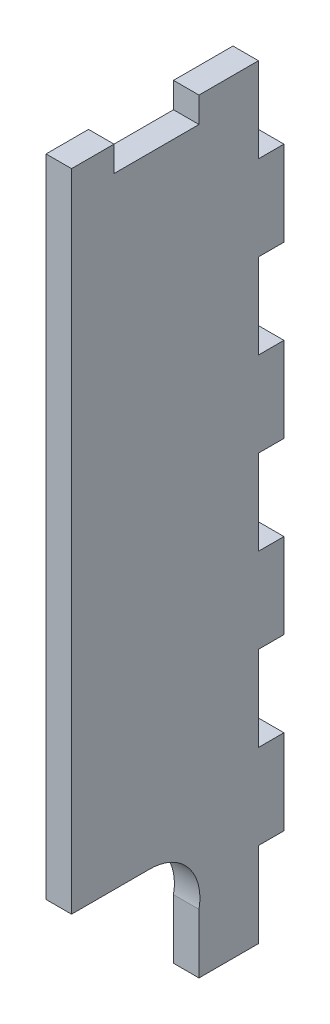
ISO-10303-21;
HEADER;
FILE_DESCRIPTION(('STEP AP214'),'2;1');
FILE_NAME('part.step','',(''),(''),'','','');
FILE_SCHEMA(('AUTOMOTIVE_DESIGN { 1 0 10303 214 1 1 1 1 }'));
ENDSEC;
DATA;
#1=APPLICATION_CONTEXT('core data for automotive mechanical design processes');
#2=APPLICATION_PROTOCOL_DEFINITION('international standard','automotive_design',2000,#1);
#3=PRODUCT_CONTEXT('',#1,'mechanical');
#4=PRODUCT('Part','Part','',(#3));
#5=PRODUCT_RELATED_PRODUCT_CATEGORY('part','',(#4));
#6=PRODUCT_DEFINITION_FORMATION('','',#4);
#7=PRODUCT_DEFINITION_CONTEXT('part definition',#1,'design');
#8=PRODUCT_DEFINITION('design','',#6,#7);
#9=PRODUCT_DEFINITION_SHAPE('','',#8);
#10=(LENGTH_UNIT() NAMED_UNIT(*) SI_UNIT(.MILLI.,.METRE.));
#11=(NAMED_UNIT(*) PLANE_ANGLE_UNIT() SI_UNIT($,.RADIAN.));
#12=(NAMED_UNIT(*) SI_UNIT($,.STERADIAN.) SOLID_ANGLE_UNIT());
#13=UNCERTAINTY_MEASURE_WITH_UNIT(LENGTH_MEASURE(1.E-05),#10,'distance_accuracy_value','');
#14=(GEOMETRIC_REPRESENTATION_CONTEXT(3) GLOBAL_UNCERTAINTY_ASSIGNED_CONTEXT((#13)) GLOBAL_UNIT_ASSIGNED_CONTEXT((#10,
#11,#12)) REPRESENTATION_CONTEXT('',''));
#15=CARTESIAN_POINT('',(0.,0.,0.));
#16=DIRECTION('',(0.,0.,1.));
#17=DIRECTION('',(1.,0.,0.));
#18=AXIS2_PLACEMENT_3D('',#15,#16,#17);
#19=CARTESIAN_POINT('',(3.,88.7204897075799,-24.7040108521535));
#20=DIRECTION('',(0.,0.,-1.));
#21=DIRECTION('',(0.,1.,0.));
#22=AXIS2_PLACEMENT_3D('',#19,#20,#21);
#23=PLANE('',#22);
#24=DIRECTION('',(0.,-1.,0.));
#25=VECTOR('',#24,1.);
#26=CARTESIAN_POINT('',(0.,88.7204897075799,-24.7040108521535));
#27=LINE('',#26,#25);
#28=CARTESIAN_POINT('',(0.,88.7204897075799,-24.7040108521535));
#29=VERTEX_POINT('',#28);
#30=CARTESIAN_POINT('',(0.,12.7204897075799,-24.7040108521535));
#31=VERTEX_POINT('',#30);
#32=EDGE_CURVE('E242',#29,#31,#27,.T.);
#33=ORIENTED_EDGE('',*,*,#32,.T.);
#34=DIRECTION('',(-1.,0.,0.));
#35=VECTOR('',#34,1.);
#36=CARTESIAN_POINT('',(3.,12.7204897075799,-24.7040108521535));
#37=LINE('',#36,#35);
#38=CARTESIAN_POINT('',(3.,12.7204897075799,-24.7040108521535));
#39=VERTEX_POINT('',#38);
#40=EDGE_CURVE('E11',#39,#31,#37,.T.);
#41=ORIENTED_EDGE('',*,*,#40,.F.);
#42=DIRECTION('',(0.,-1.,0.));
#43=VECTOR('',#42,1.);
#44=CARTESIAN_POINT('',(3.,88.7204897075799,-24.7040108521535));
#45=LINE('',#44,#43);
#46=CARTESIAN_POINT('',(3.,88.7204897075799,-24.7040108521535));
#47=VERTEX_POINT('',#46);
#48=EDGE_CURVE('E294',#47,#39,#45,.T.);
#49=ORIENTED_EDGE('',*,*,#48,.F.);
#50=DIRECTION('',(-1.,0.,0.));
#51=VECTOR('',#50,1.);
#52=CARTESIAN_POINT('',(3.,88.7204897075799,-24.7040108521535));
#53=LINE('',#52,#51);
#54=EDGE_CURVE('E238',#47,#29,#53,.T.);
#55=ORIENTED_EDGE('',*,*,#54,.T.);
#56=EDGE_LOOP('',(#33,#41,#49,#55));
#57=FACE_BOUND('',#56,.T.);
#58=ADVANCED_FACE('F32',(#57),#23,.F.);
#59=CARTESIAN_POINT('',(3.,12.7204897075799,-24.7040108521535));
#60=DIRECTION('',(0.,1.,0.));
#61=DIRECTION('',(0.,0.,1.));
#62=AXIS2_PLACEMENT_3D('',#59,#60,#61);
#63=PLANE('',#62);
#64=DIRECTION('',(0.,0.,-1.));
#65=VECTOR('',#64,1.);
#66=CARTESIAN_POINT('',(0.,12.7204897075799,-24.7040108521535));
#67=LINE('',#66,#65);
#68=CARTESIAN_POINT('',(0.,12.7204897075799,-33.7040108521536));
#69=VERTEX_POINT('',#68);
#70=EDGE_CURVE('E245',#31,#69,#67,.T.);
#71=ORIENTED_EDGE('',*,*,#70,.T.);
#72=DIRECTION('',(-1.,0.,0.));
#73=VECTOR('',#72,1.);
#74=CARTESIAN_POINT('',(3.,12.7204897075799,-33.7040108521536));
#75=LINE('',#74,#73);
#76=CARTESIAN_POINT('',(3.,12.7204897075799,-33.7040108521536));
#77=VERTEX_POINT('',#76);
#78=EDGE_CURVE('E40',#77,#69,#75,.T.);
#79=ORIENTED_EDGE('',*,*,#78,.F.);
#80=DIRECTION('',(0.,0.,-1.));
#81=VECTOR('',#80,1.);
#82=CARTESIAN_POINT('',(3.,12.7204897075799,-24.7040108521535));
#83=LINE('',#82,#81);
#84=EDGE_CURVE('E148',#39,#77,#83,.T.);
#85=ORIENTED_EDGE('',*,*,#84,.F.);
#86=ORIENTED_EDGE('',*,*,#40,.T.);
#87=EDGE_LOOP('',(#71,#79,#85,#86));
#88=FACE_BOUND('',#87,.T.);
#89=ADVANCED_FACE('F447',(#88),#63,.F.);
#90=CARTESIAN_POINT('',(3.,6.82262156207445,-33.9064980157305));
#91=DIRECTION('',(-1.,0.,0.));
#92=DIRECTION('',(0.,0.,1.));
#93=AXIS2_PLACEMENT_3D('',#90,#91,#92);
#94=CYLINDRICAL_SURFACE('',#93,5.90134304317087);
#95=CARTESIAN_POINT('',(0.,6.82262156207445,-33.9064980157305));
#96=DIRECTION('',(-1.,0.,0.));
#97=DIRECTION('',(0.,0.,1.));
#98=AXIS2_PLACEMENT_3D('',#95,#96,#97);
#99=CIRCLE('',#98,5.90134304317087);
#100=CARTESIAN_POINT('',(0.,5.72048970757988,-39.7040108521535));
#101=VERTEX_POINT('',#100);
#102=EDGE_CURVE('E247',#69,#101,#99,.T.);
#103=ORIENTED_EDGE('',*,*,#102,.T.);
#104=DIRECTION('',(-1.,0.,0.));
#105=VECTOR('',#104,1.);
#106=CARTESIAN_POINT('',(3.,5.72048970757988,-39.7040108521535));
#107=LINE('',#106,#105);
#108=CARTESIAN_POINT('',(3.,5.72048970757988,-39.7040108521535));
#109=VERTEX_POINT('',#108);
#110=EDGE_CURVE('E358',#109,#101,#107,.T.);
#111=ORIENTED_EDGE('',*,*,#110,.F.);
#112=CARTESIAN_POINT('',(3.,6.82262156207445,-33.9064980157305));
#113=DIRECTION('',(-1.,0.,0.));
#114=DIRECTION('',(0.,0.,1.));
#115=AXIS2_PLACEMENT_3D('',#112,#113,#114);
#116=CIRCLE('',#115,5.90134304317087);
#117=EDGE_CURVE('E366',#77,#109,#116,.T.);
#118=ORIENTED_EDGE('',*,*,#117,.F.);
#119=ORIENTED_EDGE('',*,*,#78,.T.);
#120=EDGE_LOOP('',(#103,#111,#118,#119));
#121=FACE_BOUND('',#120,.T.);
#122=ADVANCED_FACE('F364',(#121),#94,.F.);
#123=CARTESIAN_POINT('',(3.,-1.27951029242012,-39.7040108521535));
#124=DIRECTION('',(0.,0.,-1.));
#125=DIRECTION('',(0.,1.,0.));
#126=AXIS2_PLACEMENT_3D('',#123,#124,#125);
#127=PLANE('',#126);
#128=DIRECTION('',(0.,-1.,0.));
#129=VECTOR('',#128,1.);
#130=CARTESIAN_POINT('',(0.,-1.27951029242012,-39.7040108521535));
#131=LINE('',#130,#129);
#132=CARTESIAN_POINT('',(0.,-1.27951029242012,-39.7040108521535));
#133=VERTEX_POINT('',#132);
#134=EDGE_CURVE('E249',#101,#133,#131,.T.);
#135=ORIENTED_EDGE('',*,*,#134,.T.);
#136=DIRECTION('',(-1.,0.,0.));
#137=VECTOR('',#136,1.);
#138=CARTESIAN_POINT('',(3.,-1.27951029242012,-39.7040108521535));
#139=LINE('',#138,#137);
#140=CARTESIAN_POINT('',(3.,-1.27951029242012,-39.7040108521535));
#141=VERTEX_POINT('',#140);
#142=EDGE_CURVE('E355',#141,#133,#139,.T.);
#143=ORIENTED_EDGE('',*,*,#142,.F.);
#144=DIRECTION('',(0.,-1.,0.));
#145=VECTOR('',#144,1.);
#146=CARTESIAN_POINT('',(3.,-1.27951029242012,-39.7040108521535));
#147=LINE('',#146,#145);
#148=EDGE_CURVE('E384',#109,#141,#147,.T.);
#149=ORIENTED_EDGE('',*,*,#148,.F.);
#150=ORIENTED_EDGE('',*,*,#110,.T.);
#151=EDGE_LOOP('',(#135,#143,#149,#150));
#152=FACE_BOUND('',#151,.T.);
#153=ADVANCED_FACE('F375',(#152),#127,.F.);
#154=CARTESIAN_POINT('',(3.,-1.27951029242012,-39.7040108521535));
#155=DIRECTION('',(0.,1.,0.));
#156=DIRECTION('',(0.,0.,1.));
#157=AXIS2_PLACEMENT_3D('',#154,#155,#156);
#158=PLANE('',#157);
#159=DIRECTION('',(0.,0.,-1.));
#160=VECTOR('',#159,1.);
#161=CARTESIAN_POINT('',(0.,-1.27951029242012,-39.7040108521535));
#162=LINE('',#161,#160);
#163=CARTESIAN_POINT('',(0.,-1.27951029242012,-46.7040108521536));
#164=VERTEX_POINT('',#163);
#165=EDGE_CURVE('E251',#133,#164,#162,.T.);
#166=ORIENTED_EDGE('',*,*,#165,.T.);
#167=DIRECTION('',(-1.,0.,0.));
#168=VECTOR('',#167,1.);
#169=CARTESIAN_POINT('',(3.,-1.27951029242012,-46.7040108521536));
#170=LINE('',#169,#168);
#171=CARTESIAN_POINT('',(3.,-1.27951029242012,-46.7040108521536));
#172=VERTEX_POINT('',#171);
#173=EDGE_CURVE('E352',#172,#164,#170,.T.);
#174=ORIENTED_EDGE('',*,*,#173,.F.);
#175=DIRECTION('',(0.,0.,-1.));
#176=VECTOR('',#175,1.);
#177=CARTESIAN_POINT('',(3.,-1.27951029242012,-39.7040108521535));
#178=LINE('',#177,#176);
#179=EDGE_CURVE('E381',#141,#172,#178,.T.);
#180=ORIENTED_EDGE('',*,*,#179,.F.);
#181=ORIENTED_EDGE('',*,*,#142,.T.);
#182=EDGE_LOOP('',(#166,#174,#180,#181));
#183=FACE_BOUND('',#182,.T.);
#184=ADVANCED_FACE('F379',(#183),#158,.F.);
#185=CARTESIAN_POINT('',(3.,8.72048970757988,-46.7040108521536));
#186=DIRECTION('',(0.,0.,1.));
#187=DIRECTION('',(1.,0.,0.));
#188=AXIS2_PLACEMENT_3D('',#185,#186,#187);
#189=PLANE('',#188);
#190=DIRECTION('',(0.,1.,0.));
#191=VECTOR('',#190,1.);
#192=CARTESIAN_POINT('',(0.,8.72048970757988,-46.7040108521536));
#193=LINE('',#192,#191);
#194=CARTESIAN_POINT('',(0.,8.72048970757988,-46.7040108521536));
#195=VERTEX_POINT('',#194);
#196=EDGE_CURVE('E253',#164,#195,#193,.T.);
#197=ORIENTED_EDGE('',*,*,#196,.T.);
#198=DIRECTION('',(-1.,0.,0.));
#199=VECTOR('',#198,1.);
#200=CARTESIAN_POINT('',(3.,8.72048970757988,-46.7040108521536));
#201=LINE('',#200,#199);
#202=CARTESIAN_POINT('',(3.,8.72048970757988,-46.7040108521536));
#203=VERTEX_POINT('',#202);
#204=EDGE_CURVE('E349',#203,#195,#201,.T.);
#205=ORIENTED_EDGE('',*,*,#204,.F.);
#206=DIRECTION('',(0.,1.,0.));
#207=VECTOR('',#206,1.);
#208=CARTESIAN_POINT('',(3.,8.72048970757988,-46.7040108521536));
#209=LINE('',#208,#207);
#210=EDGE_CURVE('E383',#172,#203,#209,.T.);
#211=ORIENTED_EDGE('',*,*,#210,.F.);
#212=ORIENTED_EDGE('',*,*,#173,.T.);
#213=EDGE_LOOP('',(#197,#205,#211,#212));
#214=FACE_BOUND('',#213,.T.);
#215=ADVANCED_FACE('F460',(#214),#189,.F.);
#216=CARTESIAN_POINT('',(3.,8.72048970757988,-46.7040108521536));
#217=DIRECTION('',(0.,1.,0.));
#218=DIRECTION('',(0.,0.,1.));
#219=AXIS2_PLACEMENT_3D('',#216,#217,#218);
#220=PLANE('',#219);
#221=DIRECTION('',(0.,0.,-1.));
#222=VECTOR('',#221,1.);
#223=CARTESIAN_POINT('',(0.,8.72048970757988,-46.7040108521536));
#224=LINE('',#223,#222);
#225=CARTESIAN_POINT('',(0.,8.72048970757988,-49.7040108521536));
#226=VERTEX_POINT('',#225);
#227=EDGE_CURVE('E255',#195,#226,#224,.T.);
#228=ORIENTED_EDGE('',*,*,#227,.T.);
#229=DIRECTION('',(-1.,0.,0.));
#230=VECTOR('',#229,1.);
#231=CARTESIAN_POINT('',(3.,8.72048970757988,-49.7040108521536));
#232=LINE('',#231,#230);
#233=CARTESIAN_POINT('',(3.,8.72048970757988,-49.7040108521536));
#234=VERTEX_POINT('',#233);
#235=EDGE_CURVE('E346',#234,#226,#232,.T.);
#236=ORIENTED_EDGE('',*,*,#235,.F.);
#237=DIRECTION('',(0.,0.,-1.));
#238=VECTOR('',#237,1.);
#239=CARTESIAN_POINT('',(3.,8.72048970757988,-46.7040108521536));
#240=LINE('',#239,#238);
#241=EDGE_CURVE('E386',#203,#234,#240,.T.);
#242=ORIENTED_EDGE('',*,*,#241,.F.);
#243=ORIENTED_EDGE('',*,*,#204,.T.);
#244=EDGE_LOOP('',(#228,#236,#242,#243));
#245=FACE_BOUND('',#244,.T.);
#246=ADVANCED_FACE('F463',(#245),#220,.F.);
#247=CARTESIAN_POINT('',(3.,18.7204897075799,-49.7040108521536));
#248=DIRECTION('',(0.,0.,1.));
#249=DIRECTION('',(0.,-1.,0.));
#250=AXIS2_PLACEMENT_3D('',#247,#248,#249);
#251=PLANE('',#250);
#252=DIRECTION('',(0.,1.,0.));
#253=VECTOR('',#252,1.);
#254=CARTESIAN_POINT('',(0.,18.7204897075799,-49.7040108521536));
#255=LINE('',#254,#253);
#256=CARTESIAN_POINT('',(0.,18.7204897075799,-49.7040108521536));
#257=VERTEX_POINT('',#256);
#258=EDGE_CURVE('E257',#226,#257,#255,.T.);
#259=ORIENTED_EDGE('',*,*,#258,.T.);
#260=DIRECTION('',(-1.,0.,0.));
#261=VECTOR('',#260,1.);
#262=CARTESIAN_POINT('',(3.,18.7204897075799,-49.7040108521536));
#263=LINE('',#262,#261);
#264=CARTESIAN_POINT('',(3.,18.7204897075799,-49.7040108521536));
#265=VERTEX_POINT('',#264);
#266=EDGE_CURVE('E343',#265,#257,#263,.T.);
#267=ORIENTED_EDGE('',*,*,#266,.F.);
#268=DIRECTION('',(0.,1.,0.));
#269=VECTOR('',#268,1.);
#270=CARTESIAN_POINT('',(3.,18.7204897075799,-49.7040108521536));
#271=LINE('',#270,#269);
#272=EDGE_CURVE('E392',#234,#265,#271,.T.);
#273=ORIENTED_EDGE('',*,*,#272,.F.);
#274=ORIENTED_EDGE('',*,*,#235,.T.);
#275=EDGE_LOOP('',(#259,#267,#273,#274));
#276=FACE_BOUND('',#275,.T.);
#277=ADVANCED_FACE('F467',(#276),#251,.F.);
#278=CARTESIAN_POINT('',(3.,18.7204897075799,-46.7040108521536));
#279=DIRECTION('',(0.,-1.,0.));
#280=DIRECTION('',(0.,0.,-1.));
#281=AXIS2_PLACEMENT_3D('',#278,#279,#280);
#282=PLANE('',#281);
#283=DIRECTION('',(0.,0.,1.));
#284=VECTOR('',#283,1.);
#285=CARTESIAN_POINT('',(0.,18.7204897075799,-46.7040108521536));
#286=LINE('',#285,#284);
#287=CARTESIAN_POINT('',(0.,18.7204897075799,-46.7040108521536));
#288=VERTEX_POINT('',#287);
#289=EDGE_CURVE('E259',#257,#288,#286,.T.);
#290=ORIENTED_EDGE('',*,*,#289,.T.);
#291=DIRECTION('',(-1.,0.,0.));
#292=VECTOR('',#291,1.);
#293=CARTESIAN_POINT('',(3.,18.7204897075799,-46.7040108521536));
#294=LINE('',#293,#292);
#295=CARTESIAN_POINT('',(3.,18.7204897075799,-46.7040108521536));
#296=VERTEX_POINT('',#295);
#297=EDGE_CURVE('E340',#296,#288,#294,.T.);
#298=ORIENTED_EDGE('',*,*,#297,.F.);
#299=DIRECTION('',(0.,0.,1.));
#300=VECTOR('',#299,1.);
#301=CARTESIAN_POINT('',(3.,18.7204897075799,-46.7040108521536));
#302=LINE('',#301,#300);
#303=EDGE_CURVE('E394',#265,#296,#302,.T.);
#304=ORIENTED_EDGE('',*,*,#303,.F.);
#305=ORIENTED_EDGE('',*,*,#266,.T.);
#306=EDGE_LOOP('',(#290,#298,#304,#305));
#307=FACE_BOUND('',#306,.T.);
#308=ADVANCED_FACE('F471',(#307),#282,.F.);
#309=CARTESIAN_POINT('',(3.,28.7204897075799,-46.7040108521536));
#310=DIRECTION('',(0.,0.,1.));
#311=DIRECTION('',(0.,-1.,0.));
#312=AXIS2_PLACEMENT_3D('',#309,#310,#311);
#313=PLANE('',#312);
#314=DIRECTION('',(0.,1.,0.));
#315=VECTOR('',#314,1.);
#316=CARTESIAN_POINT('',(0.,28.7204897075799,-46.7040108521536));
#317=LINE('',#316,#315);
#318=CARTESIAN_POINT('',(0.,28.7204897075799,-46.7040108521536));
#319=VERTEX_POINT('',#318);
#320=EDGE_CURVE('E261',#288,#319,#317,.T.);
#321=ORIENTED_EDGE('',*,*,#320,.T.);
#322=DIRECTION('',(-1.,0.,0.));
#323=VECTOR('',#322,1.);
#324=CARTESIAN_POINT('',(3.,28.7204897075799,-46.7040108521536));
#325=LINE('',#324,#323);
#326=CARTESIAN_POINT('',(3.,28.7204897075799,-46.7040108521536));
#327=VERTEX_POINT('',#326);
#328=EDGE_CURVE('E337',#327,#319,#325,.T.);
#329=ORIENTED_EDGE('',*,*,#328,.F.);
#330=DIRECTION('',(0.,1.,0.));
#331=VECTOR('',#330,1.);
#332=CARTESIAN_POINT('',(3.,28.7204897075799,-46.7040108521536));
#333=LINE('',#332,#331);
#334=EDGE_CURVE('E396',#296,#327,#333,.T.);
#335=ORIENTED_EDGE('',*,*,#334,.F.);
#336=ORIENTED_EDGE('',*,*,#297,.T.);
#337=EDGE_LOOP('',(#321,#329,#335,#336));
#338=FACE_BOUND('',#337,.T.);
#339=ADVANCED_FACE('F475',(#338),#313,.F.);
#340=CARTESIAN_POINT('',(3.,28.7204897075799,-46.7040108521536));
#341=DIRECTION('',(0.,1.,0.));
#342=DIRECTION('',(0.,0.,1.));
#343=AXIS2_PLACEMENT_3D('',#340,#341,#342);
#344=PLANE('',#343);
#345=DIRECTION('',(0.,0.,-1.));
#346=VECTOR('',#345,1.);
#347=CARTESIAN_POINT('',(0.,28.7204897075799,-46.7040108521536));
#348=LINE('',#347,#346);
#349=CARTESIAN_POINT('',(0.,28.7204897075799,-49.7040108521536));
#350=VERTEX_POINT('',#349);
#351=EDGE_CURVE('E263',#319,#350,#348,.T.);
#352=ORIENTED_EDGE('',*,*,#351,.T.);
#353=DIRECTION('',(-1.,0.,0.));
#354=VECTOR('',#353,1.);
#355=CARTESIAN_POINT('',(3.,28.7204897075799,-49.7040108521536));
#356=LINE('',#355,#354);
#357=CARTESIAN_POINT('',(3.,28.7204897075799,-49.7040108521536));
#358=VERTEX_POINT('',#357);
#359=EDGE_CURVE('E334',#358,#350,#356,.T.);
#360=ORIENTED_EDGE('',*,*,#359,.F.);
#361=DIRECTION('',(0.,0.,-1.));
#362=VECTOR('',#361,1.);
#363=CARTESIAN_POINT('',(3.,28.7204897075799,-46.7040108521536));
#364=LINE('',#363,#362);
#365=EDGE_CURVE('E398',#327,#358,#364,.T.);
#366=ORIENTED_EDGE('',*,*,#365,.F.);
#367=ORIENTED_EDGE('',*,*,#328,.T.);
#368=EDGE_LOOP('',(#352,#360,#366,#367));
#369=FACE_BOUND('',#368,.T.);
#370=ADVANCED_FACE('F479',(#369),#344,.F.);
#371=CARTESIAN_POINT('',(3.,38.7204897075799,-49.7040108521536));
#372=DIRECTION('',(0.,0.,1.));
#373=DIRECTION('',(1.,0.,0.));
#374=AXIS2_PLACEMENT_3D('',#371,#372,#373);
#375=PLANE('',#374);
#376=DIRECTION('',(0.,1.,0.));
#377=VECTOR('',#376,1.);
#378=CARTESIAN_POINT('',(0.,38.7204897075799,-49.7040108521536));
#379=LINE('',#378,#377);
#380=CARTESIAN_POINT('',(0.,38.7204897075799,-49.7040108521536));
#381=VERTEX_POINT('',#380);
#382=EDGE_CURVE('E265',#350,#381,#379,.T.);
#383=ORIENTED_EDGE('',*,*,#382,.T.);
#384=DIRECTION('',(-1.,0.,0.));
#385=VECTOR('',#384,1.);
#386=CARTESIAN_POINT('',(3.,38.7204897075799,-49.7040108521536));
#387=LINE('',#386,#385);
#388=CARTESIAN_POINT('',(3.,38.7204897075799,-49.7040108521536));
#389=VERTEX_POINT('',#388);
#390=EDGE_CURVE('E331',#389,#381,#387,.T.);
#391=ORIENTED_EDGE('',*,*,#390,.F.);
#392=DIRECTION('',(0.,1.,0.));
#393=VECTOR('',#392,1.);
#394=CARTESIAN_POINT('',(3.,38.7204897075799,-49.7040108521536));
#395=LINE('',#394,#393);
#396=EDGE_CURVE('E400',#358,#389,#395,.T.);
#397=ORIENTED_EDGE('',*,*,#396,.F.);
#398=ORIENTED_EDGE('',*,*,#359,.T.);
#399=EDGE_LOOP('',(#383,#391,#397,#398));
#400=FACE_BOUND('',#399,.T.);
#401=ADVANCED_FACE('F483',(#400),#375,.F.);
#402=CARTESIAN_POINT('',(3.,38.7204897075799,-46.7040108521536));
#403=DIRECTION('',(0.,-1.,0.));
#404=DIRECTION('',(0.,0.,-1.));
#405=AXIS2_PLACEMENT_3D('',#402,#403,#404);
#406=PLANE('',#405);
#407=DIRECTION('',(0.,0.,1.));
#408=VECTOR('',#407,1.);
#409=CARTESIAN_POINT('',(0.,38.7204897075799,-46.7040108521536));
#410=LINE('',#409,#408);
#411=CARTESIAN_POINT('',(0.,38.7204897075799,-46.7040108521536));
#412=VERTEX_POINT('',#411);
#413=EDGE_CURVE('E267',#381,#412,#410,.T.);
#414=ORIENTED_EDGE('',*,*,#413,.T.);
#415=DIRECTION('',(-1.,0.,0.));
#416=VECTOR('',#415,1.);
#417=CARTESIAN_POINT('',(3.,38.7204897075799,-46.7040108521536));
#418=LINE('',#417,#416);
#419=CARTESIAN_POINT('',(3.,38.7204897075799,-46.7040108521536));
#420=VERTEX_POINT('',#419);
#421=EDGE_CURVE('E328',#420,#412,#418,.T.);
#422=ORIENTED_EDGE('',*,*,#421,.F.);
#423=DIRECTION('',(0.,0.,1.));
#424=VECTOR('',#423,1.);
#425=CARTESIAN_POINT('',(3.,38.7204897075799,-46.7040108521536));
#426=LINE('',#425,#424);
#427=EDGE_CURVE('E402',#389,#420,#426,.T.);
#428=ORIENTED_EDGE('',*,*,#427,.F.);
#429=ORIENTED_EDGE('',*,*,#390,.T.);
#430=EDGE_LOOP('',(#414,#422,#428,#429));
#431=FACE_BOUND('',#430,.T.);
#432=ADVANCED_FACE('F487',(#431),#406,.F.);
#433=CARTESIAN_POINT('',(3.,48.7204897075799,-46.7040108521536));
#434=DIRECTION('',(0.,0.,1.));
#435=DIRECTION('',(1.,0.,0.));
#436=AXIS2_PLACEMENT_3D('',#433,#434,#435);
#437=PLANE('',#436);
#438=DIRECTION('',(0.,1.,0.));
#439=VECTOR('',#438,1.);
#440=CARTESIAN_POINT('',(0.,48.7204897075799,-46.7040108521536));
#441=LINE('',#440,#439);
#442=CARTESIAN_POINT('',(0.,48.7204897075799,-46.7040108521536));
#443=VERTEX_POINT('',#442);
#444=EDGE_CURVE('E269',#412,#443,#441,.T.);
#445=ORIENTED_EDGE('',*,*,#444,.T.);
#446=DIRECTION('',(-1.,0.,0.));
#447=VECTOR('',#446,1.);
#448=CARTESIAN_POINT('',(3.,48.7204897075799,-46.7040108521536));
#449=LINE('',#448,#447);
#450=CARTESIAN_POINT('',(3.,48.7204897075799,-46.7040108521536));
#451=VERTEX_POINT('',#450);
#452=EDGE_CURVE('E325',#451,#443,#449,.T.);
#453=ORIENTED_EDGE('',*,*,#452,.F.);
#454=DIRECTION('',(0.,1.,0.));
#455=VECTOR('',#454,1.);
#456=CARTESIAN_POINT('',(3.,48.7204897075799,-46.7040108521536));
#457=LINE('',#456,#455);
#458=EDGE_CURVE('E404',#420,#451,#457,.T.);
#459=ORIENTED_EDGE('',*,*,#458,.F.);
#460=ORIENTED_EDGE('',*,*,#421,.T.);
#461=EDGE_LOOP('',(#445,#453,#459,#460));
#462=FACE_BOUND('',#461,.T.);
#463=ADVANCED_FACE('F491',(#462),#437,.F.);
#464=CARTESIAN_POINT('',(3.,48.7204897075799,-46.7040108521536));
#465=DIRECTION('',(0.,1.,0.));
#466=DIRECTION('',(0.,0.,1.));
#467=AXIS2_PLACEMENT_3D('',#464,#465,#466);
#468=PLANE('',#467);
#469=DIRECTION('',(0.,0.,-1.));
#470=VECTOR('',#469,1.);
#471=CARTESIAN_POINT('',(0.,48.7204897075799,-46.7040108521536));
#472=LINE('',#471,#470);
#473=CARTESIAN_POINT('',(0.,48.7204897075799,-49.7040108521536));
#474=VERTEX_POINT('',#473);
#475=EDGE_CURVE('E271',#443,#474,#472,.T.);
#476=ORIENTED_EDGE('',*,*,#475,.T.);
#477=DIRECTION('',(-1.,0.,0.));
#478=VECTOR('',#477,1.);
#479=CARTESIAN_POINT('',(3.,48.7204897075799,-49.7040108521536));
#480=LINE('',#479,#478);
#481=CARTESIAN_POINT('',(3.,48.7204897075799,-49.7040108521536));
#482=VERTEX_POINT('',#481);
#483=EDGE_CURVE('E322',#482,#474,#480,.T.);
#484=ORIENTED_EDGE('',*,*,#483,.F.);
#485=DIRECTION('',(0.,0.,-1.));
#486=VECTOR('',#485,1.);
#487=CARTESIAN_POINT('',(3.,48.7204897075799,-46.7040108521536));
#488=LINE('',#487,#486);
#489=EDGE_CURVE('E406',#451,#482,#488,.T.);
#490=ORIENTED_EDGE('',*,*,#489,.F.);
#491=ORIENTED_EDGE('',*,*,#452,.T.);
#492=EDGE_LOOP('',(#476,#484,#490,#491));
#493=FACE_BOUND('',#492,.T.);
#494=ADVANCED_FACE('F495',(#493),#468,.F.);
#495=CARTESIAN_POINT('',(3.,58.7204897075799,-49.7040108521536));
#496=DIRECTION('',(0.,0.,1.));
#497=DIRECTION('',(0.,-1.,0.));
#498=AXIS2_PLACEMENT_3D('',#495,#496,#497);
#499=PLANE('',#498);
#500=DIRECTION('',(0.,1.,0.));
#501=VECTOR('',#500,1.);
#502=CARTESIAN_POINT('',(0.,58.7204897075799,-49.7040108521536));
#503=LINE('',#502,#501);
#504=CARTESIAN_POINT('',(0.,58.7204897075799,-49.7040108521536));
#505=VERTEX_POINT('',#504);
#506=EDGE_CURVE('E273',#474,#505,#503,.T.);
#507=ORIENTED_EDGE('',*,*,#506,.T.);
#508=DIRECTION('',(-1.,0.,0.));
#509=VECTOR('',#508,1.);
#510=CARTESIAN_POINT('',(3.,58.7204897075799,-49.7040108521536));
#511=LINE('',#510,#509);
#512=CARTESIAN_POINT('',(3.,58.7204897075799,-49.7040108521536));
#513=VERTEX_POINT('',#512);
#514=EDGE_CURVE('E319',#513,#505,#511,.T.);
#515=ORIENTED_EDGE('',*,*,#514,.F.);
#516=DIRECTION('',(0.,1.,0.));
#517=VECTOR('',#516,1.);
#518=CARTESIAN_POINT('',(3.,58.7204897075799,-49.7040108521536));
#519=LINE('',#518,#517);
#520=EDGE_CURVE('E408',#482,#513,#519,.T.);
#521=ORIENTED_EDGE('',*,*,#520,.F.);
#522=ORIENTED_EDGE('',*,*,#483,.T.);
#523=EDGE_LOOP('',(#507,#515,#521,#522));
#524=FACE_BOUND('',#523,.T.);
#525=ADVANCED_FACE('F499',(#524),#499,.F.);
#526=CARTESIAN_POINT('',(3.,58.7204897075799,-46.7040108521535));
#527=DIRECTION('',(0.,-1.,0.));
#528=DIRECTION('',(0.,0.,-1.));
#529=AXIS2_PLACEMENT_3D('',#526,#527,#528);
#530=PLANE('',#529);
#531=DIRECTION('',(0.,0.,1.));
#532=VECTOR('',#531,1.);
#533=CARTESIAN_POINT('',(0.,58.7204897075799,-46.7040108521535));
#534=LINE('',#533,#532);
#535=CARTESIAN_POINT('',(0.,58.7204897075799,-46.7040108521535));
#536=VERTEX_POINT('',#535);
#537=EDGE_CURVE('E275',#505,#536,#534,.T.);
#538=ORIENTED_EDGE('',*,*,#537,.T.);
#539=DIRECTION('',(-1.,0.,0.));
#540=VECTOR('',#539,1.);
#541=CARTESIAN_POINT('',(3.,58.7204897075799,-46.7040108521535));
#542=LINE('',#541,#540);
#543=CARTESIAN_POINT('',(3.,58.7204897075799,-46.7040108521535));
#544=VERTEX_POINT('',#543);
#545=EDGE_CURVE('E316',#544,#536,#542,.T.);
#546=ORIENTED_EDGE('',*,*,#545,.F.);
#547=DIRECTION('',(0.,0.,1.));
#548=VECTOR('',#547,1.);
#549=CARTESIAN_POINT('',(3.,58.7204897075799,-46.7040108521535));
#550=LINE('',#549,#548);
#551=EDGE_CURVE('E410',#513,#544,#550,.T.);
#552=ORIENTED_EDGE('',*,*,#551,.F.);
#553=ORIENTED_EDGE('',*,*,#514,.T.);
#554=EDGE_LOOP('',(#538,#546,#552,#553));
#555=FACE_BOUND('',#554,.T.);
#556=ADVANCED_FACE('F503',(#555),#530,.F.);
#557=CARTESIAN_POINT('',(3.,68.7204897075799,-46.7040108521535));
#558=DIRECTION('',(0.,0.,1.));
#559=DIRECTION('',(0.,-1.,0.));
#560=AXIS2_PLACEMENT_3D('',#557,#558,#559);
#561=PLANE('',#560);
#562=DIRECTION('',(0.,1.,0.));
#563=VECTOR('',#562,1.);
#564=CARTESIAN_POINT('',(0.,68.7204897075799,-46.7040108521535));
#565=LINE('',#564,#563);
#566=CARTESIAN_POINT('',(0.,68.7204897075799,-46.7040108521535));
#567=VERTEX_POINT('',#566);
#568=EDGE_CURVE('E277',#536,#567,#565,.T.);
#569=ORIENTED_EDGE('',*,*,#568,.T.);
#570=DIRECTION('',(-1.,0.,0.));
#571=VECTOR('',#570,1.);
#572=CARTESIAN_POINT('',(3.,68.7204897075799,-46.7040108521535));
#573=LINE('',#572,#571);
#574=CARTESIAN_POINT('',(3.,68.7204897075799,-46.7040108521535));
#575=VERTEX_POINT('',#574);
#576=EDGE_CURVE('E313',#575,#567,#573,.T.);
#577=ORIENTED_EDGE('',*,*,#576,.F.);
#578=DIRECTION('',(0.,1.,0.));
#579=VECTOR('',#578,1.);
#580=CARTESIAN_POINT('',(3.,68.7204897075799,-46.7040108521535));
#581=LINE('',#580,#579);
#582=EDGE_CURVE('E412',#544,#575,#581,.T.);
#583=ORIENTED_EDGE('',*,*,#582,.F.);
#584=ORIENTED_EDGE('',*,*,#545,.T.);
#585=EDGE_LOOP('',(#569,#577,#583,#584));
#586=FACE_BOUND('',#585,.T.);
#587=ADVANCED_FACE('F507',(#586),#561,.F.);
#588=CARTESIAN_POINT('',(3.,68.7204897075799,-46.7040108521535));
#589=DIRECTION('',(0.,1.,0.));
#590=DIRECTION('',(0.,0.,1.));
#591=AXIS2_PLACEMENT_3D('',#588,#589,#590);
#592=PLANE('',#591);
#593=DIRECTION('',(0.,0.,-1.));
#594=VECTOR('',#593,1.);
#595=CARTESIAN_POINT('',(0.,68.7204897075799,-46.7040108521535));
#596=LINE('',#595,#594);
#597=CARTESIAN_POINT('',(0.,68.7204897075799,-49.7040108521536));
#598=VERTEX_POINT('',#597);
#599=EDGE_CURVE('E279',#567,#598,#596,.T.);
#600=ORIENTED_EDGE('',*,*,#599,.T.);
#601=DIRECTION('',(-1.,0.,0.));
#602=VECTOR('',#601,1.);
#603=CARTESIAN_POINT('',(3.,68.7204897075799,-49.7040108521536));
#604=LINE('',#603,#602);
#605=CARTESIAN_POINT('',(3.,68.7204897075799,-49.7040108521536));
#606=VERTEX_POINT('',#605);
#607=EDGE_CURVE('E310',#606,#598,#604,.T.);
#608=ORIENTED_EDGE('',*,*,#607,.F.);
#609=DIRECTION('',(0.,0.,-1.));
#610=VECTOR('',#609,1.);
#611=CARTESIAN_POINT('',(3.,68.7204897075799,-46.7040108521535));
#612=LINE('',#611,#610);
#613=EDGE_CURVE('E414',#575,#606,#612,.T.);
#614=ORIENTED_EDGE('',*,*,#613,.F.);
#615=ORIENTED_EDGE('',*,*,#576,.T.);
#616=EDGE_LOOP('',(#600,#608,#614,#615));
#617=FACE_BOUND('',#616,.T.);
#618=ADVANCED_FACE('F511',(#617),#592,.F.);
#619=CARTESIAN_POINT('',(3.,78.7204897075799,-49.7040108521536));
#620=DIRECTION('',(0.,0.,1.));
#621=DIRECTION('',(1.,0.,0.));
#622=AXIS2_PLACEMENT_3D('',#619,#620,#621);
#623=PLANE('',#622);
#624=DIRECTION('',(0.,1.,0.));
#625=VECTOR('',#624,1.);
#626=CARTESIAN_POINT('',(0.,78.7204897075799,-49.7040108521536));
#627=LINE('',#626,#625);
#628=CARTESIAN_POINT('',(0.,78.7204897075799,-49.7040108521536));
#629=VERTEX_POINT('',#628);
#630=EDGE_CURVE('E281',#598,#629,#627,.T.);
#631=ORIENTED_EDGE('',*,*,#630,.T.);
#632=DIRECTION('',(-1.,0.,0.));
#633=VECTOR('',#632,1.);
#634=CARTESIAN_POINT('',(3.,78.7204897075799,-49.7040108521536));
#635=LINE('',#634,#633);
#636=CARTESIAN_POINT('',(3.,78.7204897075799,-49.7040108521536));
#637=VERTEX_POINT('',#636);
#638=EDGE_CURVE('E307',#637,#629,#635,.T.);
#639=ORIENTED_EDGE('',*,*,#638,.F.);
#640=DIRECTION('',(0.,1.,0.));
#641=VECTOR('',#640,1.);
#642=CARTESIAN_POINT('',(3.,78.7204897075799,-49.7040108521536));
#643=LINE('',#642,#641);
#644=EDGE_CURVE('E416',#606,#637,#643,.T.);
#645=ORIENTED_EDGE('',*,*,#644,.F.);
#646=ORIENTED_EDGE('',*,*,#607,.T.);
#647=EDGE_LOOP('',(#631,#639,#645,#646));
#648=FACE_BOUND('',#647,.T.);
#649=ADVANCED_FACE('F515',(#648),#623,.F.);
#650=CARTESIAN_POINT('',(3.,78.7204897075799,-46.7040108521535));
#651=DIRECTION('',(0.,-1.,0.));
#652=DIRECTION('',(0.,0.,-1.));
#653=AXIS2_PLACEMENT_3D('',#650,#651,#652);
#654=PLANE('',#653);
#655=DIRECTION('',(0.,0.,1.));
#656=VECTOR('',#655,1.);
#657=CARTESIAN_POINT('',(0.,78.7204897075799,-46.7040108521535));
#658=LINE('',#657,#656);
#659=CARTESIAN_POINT('',(0.,78.7204897075799,-46.7040108521535));
#660=VERTEX_POINT('',#659);
#661=EDGE_CURVE('E283',#629,#660,#658,.T.);
#662=ORIENTED_EDGE('',*,*,#661,.T.);
#663=DIRECTION('',(-1.,0.,0.));
#664=VECTOR('',#663,1.);
#665=CARTESIAN_POINT('',(3.,78.7204897075799,-46.7040108521535));
#666=LINE('',#665,#664);
#667=CARTESIAN_POINT('',(3.,78.7204897075799,-46.7040108521535));
#668=VERTEX_POINT('',#667);
#669=EDGE_CURVE('E304',#668,#660,#666,.T.);
#670=ORIENTED_EDGE('',*,*,#669,.F.);
#671=DIRECTION('',(0.,0.,1.));
#672=VECTOR('',#671,1.);
#673=CARTESIAN_POINT('',(3.,78.7204897075799,-46.7040108521535));
#674=LINE('',#673,#672);
#675=EDGE_CURVE('E418',#637,#668,#674,.T.);
#676=ORIENTED_EDGE('',*,*,#675,.F.);
#677=ORIENTED_EDGE('',*,*,#638,.T.);
#678=EDGE_LOOP('',(#662,#670,#676,#677));
#679=FACE_BOUND('',#678,.T.);
#680=ADVANCED_FACE('F519',(#679),#654,.F.);
#681=CARTESIAN_POINT('',(3.,88.7204897075799,-46.7040108521535));
#682=DIRECTION('',(0.,0.,1.));
#683=DIRECTION('',(0.,-1.,0.));
#684=AXIS2_PLACEMENT_3D('',#681,#682,#683);
#685=PLANE('',#684);
#686=DIRECTION('',(0.,1.,0.));
#687=VECTOR('',#686,1.);
#688=CARTESIAN_POINT('',(0.,88.7204897075799,-46.7040108521535));
#689=LINE('',#688,#687);
#690=CARTESIAN_POINT('',(0.,88.7204897075799,-46.7040108521535));
#691=VERTEX_POINT('',#690);
#692=EDGE_CURVE('E285',#660,#691,#689,.T.);
#693=ORIENTED_EDGE('',*,*,#692,.T.);
#694=DIRECTION('',(-1.,0.,0.));
#695=VECTOR('',#694,1.);
#696=CARTESIAN_POINT('',(3.,88.7204897075799,-46.7040108521535));
#697=LINE('',#696,#695);
#698=CARTESIAN_POINT('',(3.,88.7204897075799,-46.7040108521535));
#699=VERTEX_POINT('',#698);
#700=EDGE_CURVE('E301',#699,#691,#697,.T.);
#701=ORIENTED_EDGE('',*,*,#700,.F.);
#702=DIRECTION('',(0.,1.,0.));
#703=VECTOR('',#702,1.);
#704=CARTESIAN_POINT('',(3.,88.7204897075799,-46.7040108521535));
#705=LINE('',#704,#703);
#706=EDGE_CURVE('E420',#668,#699,#705,.T.);
#707=ORIENTED_EDGE('',*,*,#706,.F.);
#708=ORIENTED_EDGE('',*,*,#669,.T.);
#709=EDGE_LOOP('',(#693,#701,#707,#708));
#710=FACE_BOUND('',#709,.T.);
#711=ADVANCED_FACE('F523',(#710),#685,.F.);
#712=CARTESIAN_POINT('',(3.,88.7204897075799,-39.7040108521535));
#713=DIRECTION('',(0.,-1.,0.));
#714=DIRECTION('',(0.,0.,-1.));
#715=AXIS2_PLACEMENT_3D('',#712,#713,#714);
#716=PLANE('',#715);
#717=DIRECTION('',(0.,0.,1.));
#718=VECTOR('',#717,1.);
#719=CARTESIAN_POINT('',(0.,88.7204897075799,-39.7040108521535));
#720=LINE('',#719,#718);
#721=CARTESIAN_POINT('',(0.,88.7204897075799,-39.7040108521535));
#722=VERTEX_POINT('',#721);
#723=EDGE_CURVE('E287',#691,#722,#720,.T.);
#724=ORIENTED_EDGE('',*,*,#723,.T.);
#725=DIRECTION('',(-1.,0.,0.));
#726=VECTOR('',#725,1.);
#727=CARTESIAN_POINT('',(3.,88.7204897075799,-39.7040108521535));
#728=LINE('',#727,#726);
#729=CARTESIAN_POINT('',(3.,88.7204897075799,-39.7040108521535));
#730=VERTEX_POINT('',#729);
#731=EDGE_CURVE('E298',#730,#722,#728,.T.);
#732=ORIENTED_EDGE('',*,*,#731,.F.);
#733=DIRECTION('',(0.,0.,1.));
#734=VECTOR('',#733,1.);
#735=CARTESIAN_POINT('',(3.,88.7204897075799,-39.7040108521535));
#736=LINE('',#735,#734);
#737=EDGE_CURVE('E422',#699,#730,#736,.T.);
#738=ORIENTED_EDGE('',*,*,#737,.F.);
#739=ORIENTED_EDGE('',*,*,#700,.T.);
#740=EDGE_LOOP('',(#724,#732,#738,#739));
#741=FACE_BOUND('',#740,.T.);
#742=ADVANCED_FACE('F428',(#741),#716,.F.);
#743=CARTESIAN_POINT('',(3.,88.7204897075799,-39.7040108521535));
#744=DIRECTION('',(0.,0.,-1.));
#745=DIRECTION('',(-1.,0.,0.));
#746=AXIS2_PLACEMENT_3D('',#743,#744,#745);
#747=PLANE('',#746);
#748=DIRECTION('',(0.,-1.,0.));
#749=VECTOR('',#748,1.);
#750=CARTESIAN_POINT('',(0.,88.7204897075799,-39.7040108521535));
#751=LINE('',#750,#749);
#752=CARTESIAN_POINT('',(0.,85.7204897075799,-39.7040108521535));
#753=VERTEX_POINT('',#752);
#754=EDGE_CURVE('E289',#722,#753,#751,.T.);
#755=ORIENTED_EDGE('',*,*,#754,.T.);
#756=DIRECTION('',(-1.,0.,0.));
#757=VECTOR('',#756,1.);
#758=CARTESIAN_POINT('',(3.,85.7204897075799,-39.7040108521535));
#759=LINE('',#758,#757);
#760=CARTESIAN_POINT('',(3.,85.7204897075799,-39.7040108521535));
#761=VERTEX_POINT('',#760);
#762=EDGE_CURVE('E233',#761,#753,#759,.T.);
#763=ORIENTED_EDGE('',*,*,#762,.F.);
#764=DIRECTION('',(0.,-1.,0.));
#765=VECTOR('',#764,1.);
#766=CARTESIAN_POINT('',(3.,88.7204897075799,-39.7040108521535));
#767=LINE('',#766,#765);
#768=EDGE_CURVE('E224',#730,#761,#767,.T.);
#769=ORIENTED_EDGE('',*,*,#768,.F.);
#770=ORIENTED_EDGE('',*,*,#731,.T.);
#771=EDGE_LOOP('',(#755,#763,#769,#770));
#772=FACE_BOUND('',#771,.T.);
#773=ADVANCED_FACE('F432',(#772),#747,.F.);
#774=CARTESIAN_POINT('',(3.,85.7204897075799,-29.7040108521535));
#775=DIRECTION('',(0.,-1.,0.));
#776=DIRECTION('',(0.,0.,-1.));
#777=AXIS2_PLACEMENT_3D('',#774,#775,#776);
#778=PLANE('',#777);
#779=DIRECTION('',(0.,0.,1.));
#780=VECTOR('',#779,1.);
#781=CARTESIAN_POINT('',(0.,85.7204897075799,-29.7040108521535));
#782=LINE('',#781,#780);
#783=CARTESIAN_POINT('',(0.,85.7204897075799,-29.7040108521535));
#784=VERTEX_POINT('',#783);
#785=EDGE_CURVE('E232',#753,#784,#782,.T.);
#786=ORIENTED_EDGE('',*,*,#785,.T.);
#787=DIRECTION('',(-1.,0.,0.));
#788=VECTOR('',#787,1.);
#789=CARTESIAN_POINT('',(3.,85.7204897075799,-29.7040108521535));
#790=LINE('',#789,#788);
#791=CARTESIAN_POINT('',(3.,85.7204897075799,-29.7040108521535));
#792=VERTEX_POINT('',#791);
#793=EDGE_CURVE('E229',#792,#784,#790,.T.);
#794=ORIENTED_EDGE('',*,*,#793,.F.);
#795=DIRECTION('',(0.,0.,1.));
#796=VECTOR('',#795,1.);
#797=CARTESIAN_POINT('',(3.,85.7204897075799,-29.7040108521535));
#798=LINE('',#797,#796);
#799=EDGE_CURVE('E218',#761,#792,#798,.T.);
#800=ORIENTED_EDGE('',*,*,#799,.F.);
#801=ORIENTED_EDGE('',*,*,#762,.T.);
#802=EDGE_LOOP('',(#786,#794,#800,#801));
#803=FACE_BOUND('',#802,.T.);
#804=ADVANCED_FACE('F230',(#803),#778,.F.);
#805=CARTESIAN_POINT('',(3.,88.7204897075799,-29.7040108521535));
#806=DIRECTION('',(0.,0.,1.));
#807=DIRECTION('',(1.,0.,0.));
#808=AXIS2_PLACEMENT_3D('',#805,#806,#807);
#809=PLANE('',#808);
#810=DIRECTION('',(0.,1.,0.));
#811=VECTOR('',#810,1.);
#812=CARTESIAN_POINT('',(0.,88.7204897075799,-29.7040108521535));
#813=LINE('',#812,#811);
#814=CARTESIAN_POINT('',(0.,88.7204897075799,-29.7040108521535));
#815=VERTEX_POINT('',#814);
#816=EDGE_CURVE('E134',#784,#815,#813,.T.);
#817=ORIENTED_EDGE('',*,*,#816,.T.);
#818=DIRECTION('',(-1.,0.,0.));
#819=VECTOR('',#818,1.);
#820=CARTESIAN_POINT('',(3.,88.7204897075799,-29.7040108521535));
#821=LINE('',#820,#819);
#822=CARTESIAN_POINT('',(3.,88.7204897075799,-29.7040108521535));
#823=VERTEX_POINT('',#822);
#824=EDGE_CURVE('E234',#823,#815,#821,.T.);
#825=ORIENTED_EDGE('',*,*,#824,.F.);
#826=DIRECTION('',(0.,1.,0.));
#827=VECTOR('',#826,1.);
#828=CARTESIAN_POINT('',(3.,88.7204897075799,-29.7040108521535));
#829=LINE('',#828,#827);
#830=EDGE_CURVE('E222',#792,#823,#829,.T.);
#831=ORIENTED_EDGE('',*,*,#830,.F.);
#832=ORIENTED_EDGE('',*,*,#793,.T.);
#833=EDGE_LOOP('',(#817,#825,#831,#832));
#834=FACE_BOUND('',#833,.T.);
#835=ADVANCED_FACE('F236',(#834),#809,.F.);
#836=CARTESIAN_POINT('',(3.,88.7204897075799,-24.7040108521535));
#837=DIRECTION('',(0.,-1.,0.));
#838=DIRECTION('',(0.,0.,-1.));
#839=AXIS2_PLACEMENT_3D('',#836,#837,#838);
#840=PLANE('',#839);
#841=DIRECTION('',(0.,0.,1.));
#842=VECTOR('',#841,1.);
#843=CARTESIAN_POINT('',(0.,88.7204897075799,-24.7040108521535));
#844=LINE('',#843,#842);
#845=EDGE_CURVE('E140',#815,#29,#844,.T.);
#846=ORIENTED_EDGE('',*,*,#845,.T.);
#847=ORIENTED_EDGE('',*,*,#54,.F.);
#848=DIRECTION('',(0.,0.,1.));
#849=VECTOR('',#848,1.);
#850=CARTESIAN_POINT('',(3.,88.7204897075799,-24.7040108521535));
#851=LINE('',#850,#849);
#852=EDGE_CURVE('E48',#823,#47,#851,.T.);
#853=ORIENTED_EDGE('',*,*,#852,.F.);
#854=ORIENTED_EDGE('',*,*,#824,.T.);
#855=EDGE_LOOP('',(#846,#847,#853,#854));
#856=FACE_BOUND('',#855,.T.);
#857=ADVANCED_FACE('F436',(#856),#840,.F.);
#858=CARTESIAN_POINT('',(3.,6.82262156207445,-33.9064980157305));
#859=DIRECTION('',(-1.,0.,0.));
#860=DIRECTION('',(0.,0.,1.));
#861=AXIS2_PLACEMENT_3D('',#858,#859,#860);
#862=PLANE('',#861);
#863=ORIENTED_EDGE('',*,*,#48,.T.);
#864=ORIENTED_EDGE('',*,*,#84,.T.);
#865=ORIENTED_EDGE('',*,*,#117,.T.);
#866=ORIENTED_EDGE('',*,*,#148,.T.);
#867=ORIENTED_EDGE('',*,*,#179,.T.);
#868=ORIENTED_EDGE('',*,*,#210,.T.);
#869=ORIENTED_EDGE('',*,*,#241,.T.);
#870=ORIENTED_EDGE('',*,*,#272,.T.);
#871=ORIENTED_EDGE('',*,*,#303,.T.);
#872=ORIENTED_EDGE('',*,*,#334,.T.);
#873=ORIENTED_EDGE('',*,*,#365,.T.);
#874=ORIENTED_EDGE('',*,*,#396,.T.);
#875=ORIENTED_EDGE('',*,*,#427,.T.);
#876=ORIENTED_EDGE('',*,*,#458,.T.);
#877=ORIENTED_EDGE('',*,*,#489,.T.);
#878=ORIENTED_EDGE('',*,*,#520,.T.);
#879=ORIENTED_EDGE('',*,*,#551,.T.);
#880=ORIENTED_EDGE('',*,*,#582,.T.);
#881=ORIENTED_EDGE('',*,*,#613,.T.);
#882=ORIENTED_EDGE('',*,*,#644,.T.);
#883=ORIENTED_EDGE('',*,*,#675,.T.);
#884=ORIENTED_EDGE('',*,*,#706,.T.);
#885=ORIENTED_EDGE('',*,*,#737,.T.);
#886=ORIENTED_EDGE('',*,*,#768,.T.);
#887=ORIENTED_EDGE('',*,*,#799,.T.);
#888=ORIENTED_EDGE('',*,*,#830,.T.);
#889=ORIENTED_EDGE('',*,*,#852,.T.);
#890=EDGE_LOOP('',(#863,#864,#865,#866,#867,#868,#869,#870,#871,#872,#873,#874,#875,#876,#877,
#878,#879,#880,#881,#882,#883,#884,#885,#886,#887,#888,#889));
#891=FACE_BOUND('',#890,.T.);
#892=ADVANCED_FACE('F220',(#891),#862,.F.);
#893=CARTESIAN_POINT('',(0.,6.82262156207445,-33.9064980157305));
#894=DIRECTION('',(-1.,0.,0.));
#895=DIRECTION('',(0.,0.,1.));
#896=AXIS2_PLACEMENT_3D('',#893,#894,#895);
#897=PLANE('',#896);
#898=ORIENTED_EDGE('',*,*,#32,.F.);
#899=ORIENTED_EDGE('',*,*,#845,.F.);
#900=ORIENTED_EDGE('',*,*,#816,.F.);
#901=ORIENTED_EDGE('',*,*,#785,.F.);
#902=ORIENTED_EDGE('',*,*,#754,.F.);
#903=ORIENTED_EDGE('',*,*,#723,.F.);
#904=ORIENTED_EDGE('',*,*,#692,.F.);
#905=ORIENTED_EDGE('',*,*,#661,.F.);
#906=ORIENTED_EDGE('',*,*,#630,.F.);
#907=ORIENTED_EDGE('',*,*,#599,.F.);
#908=ORIENTED_EDGE('',*,*,#568,.F.);
#909=ORIENTED_EDGE('',*,*,#537,.F.);
#910=ORIENTED_EDGE('',*,*,#506,.F.);
#911=ORIENTED_EDGE('',*,*,#475,.F.);
#912=ORIENTED_EDGE('',*,*,#444,.F.);
#913=ORIENTED_EDGE('',*,*,#413,.F.);
#914=ORIENTED_EDGE('',*,*,#382,.F.);
#915=ORIENTED_EDGE('',*,*,#351,.F.);
#916=ORIENTED_EDGE('',*,*,#320,.F.);
#917=ORIENTED_EDGE('',*,*,#289,.F.);
#918=ORIENTED_EDGE('',*,*,#258,.F.);
#919=ORIENTED_EDGE('',*,*,#227,.F.);
#920=ORIENTED_EDGE('',*,*,#196,.F.);
#921=ORIENTED_EDGE('',*,*,#165,.F.);
#922=ORIENTED_EDGE('',*,*,#134,.F.);
#923=ORIENTED_EDGE('',*,*,#102,.F.);
#924=ORIENTED_EDGE('',*,*,#70,.F.);
#925=EDGE_LOOP('',(#898,#899,#900,#901,#902,#903,#904,#905,#906,#907,#908,#909,#910,#911,#912,
#913,#914,#915,#916,#917,#918,#919,#920,#921,#922,#923,#924));
#926=FACE_BOUND('',#925,.T.);
#927=ADVANCED_FACE('F370',(#926),#897,.T.);
#928=CLOSED_SHELL('',(#58,#89,#122,#153,#184,#215,#246,#277,#308,#339,#370,#401,#432,#463,#494,
#525,#556,#587,#618,#649,#680,#711,#742,#773,#804,#835,#857,#892,#927));
#929=MANIFOLD_SOLID_BREP('B2',#928);
#930=ADVANCED_BREP_SHAPE_REPRESENTATION('',(#18,#929),#14);
#931=SHAPE_DEFINITION_REPRESENTATION(#9,#930);
ENDSEC;
END-ISO-10303-21;
